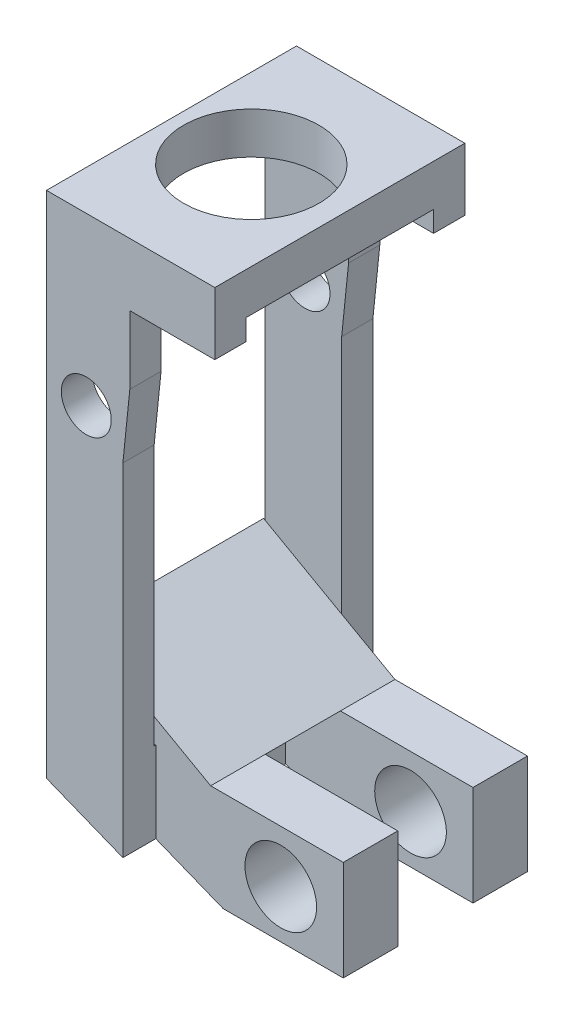
ISO-10303-21;
HEADER;
FILE_DESCRIPTION(('STEP AP214'),'2;1');
FILE_NAME('part.step','',(''),(''),'','','');
FILE_SCHEMA(('AUTOMOTIVE_DESIGN { 1 0 10303 214 1 1 1 1 }'));
ENDSEC;
DATA;
#1=APPLICATION_CONTEXT('core data for automotive mechanical design processes');
#2=APPLICATION_PROTOCOL_DEFINITION('international standard','automotive_design',2000,#1);
#3=PRODUCT_CONTEXT('',#1,'mechanical');
#4=PRODUCT('Part','Part','',(#3));
#5=PRODUCT_RELATED_PRODUCT_CATEGORY('part','',(#4));
#6=PRODUCT_DEFINITION_FORMATION('','',#4);
#7=PRODUCT_DEFINITION_CONTEXT('part definition',#1,'design');
#8=PRODUCT_DEFINITION('design','',#6,#7);
#9=PRODUCT_DEFINITION_SHAPE('','',#8);
#10=(LENGTH_UNIT() NAMED_UNIT(*) SI_UNIT(.MILLI.,.METRE.));
#11=(NAMED_UNIT(*) PLANE_ANGLE_UNIT() SI_UNIT($,.RADIAN.));
#12=(NAMED_UNIT(*) SI_UNIT($,.STERADIAN.) SOLID_ANGLE_UNIT());
#13=UNCERTAINTY_MEASURE_WITH_UNIT(LENGTH_MEASURE(1.E-05),#10,'distance_accuracy_value','');
#14=(GEOMETRIC_REPRESENTATION_CONTEXT(3) GLOBAL_UNCERTAINTY_ASSIGNED_CONTEXT((#13)) GLOBAL_UNIT_ASSIGNED_CONTEXT((#10,
#11,#12)) REPRESENTATION_CONTEXT('',''));
#15=CARTESIAN_POINT('',(0.,0.,0.));
#16=DIRECTION('',(0.,0.,1.));
#17=DIRECTION('',(1.,0.,0.));
#18=AXIS2_PLACEMENT_3D('',#15,#16,#17);
#19=CARTESIAN_POINT('',(-0.163336804675395,-25.5,4.5));
#20=DIRECTION('',(-1.,0.,0.));
#21=DIRECTION('',(0.,0.,1.));
#22=AXIS2_PLACEMENT_3D('',#19,#20,#21);
#23=PLANE('',#22);
#24=DIRECTION('',(0.,-1.,0.));
#25=VECTOR('',#24,1.);
#26=CARTESIAN_POINT('',(-0.163336804675397,-20.390050772096,-1.80504704323872));
#27=LINE('',#26,#25);
#28=CARTESIAN_POINT('',(-0.163336804675397,-20.390050772096,-1.80504704323872));
#29=VERTEX_POINT('',#28);
#30=CARTESIAN_POINT('',(-0.163336804675396,-23.9060070275788,-1.80504704323872));
#31=VERTEX_POINT('',#30);
#32=EDGE_CURVE('E373',#29,#31,#27,.T.);
#33=ORIENTED_EDGE('',*,*,#32,.F.);
#34=DIRECTION('',(0.,0.,1.));
#35=VECTOR('',#34,1.);
#36=CARTESIAN_POINT('',(-0.163336804675395,-20.390050772096,4.5));
#37=LINE('',#36,#35);
#38=CARTESIAN_POINT('',(-0.163336804675396,-20.390050772096,1.80504704323873));
#39=VERTEX_POINT('',#38);
#40=EDGE_CURVE('E280',#29,#39,#37,.T.);
#41=ORIENTED_EDGE('',*,*,#40,.T.);
#42=DIRECTION('',(0.,1.,0.));
#43=VECTOR('',#42,1.);
#44=CARTESIAN_POINT('',(-0.163336804675395,-20.390050772096,1.80504704323873));
#45=LINE('',#44,#43);
#46=CARTESIAN_POINT('',(-0.163336804675396,-23.9060070275788,1.80504704323873));
#47=VERTEX_POINT('',#46);
#48=EDGE_CURVE('E342',#47,#39,#45,.T.);
#49=ORIENTED_EDGE('',*,*,#48,.F.);
#50=DIRECTION('',(0.,0.,-1.));
#51=VECTOR('',#50,1.);
#52=CARTESIAN_POINT('',(-0.163336804675395,-23.9060070275788,4.5));
#53=LINE('',#52,#51);
#54=EDGE_CURVE('E305',#47,#31,#53,.T.);
#55=ORIENTED_EDGE('',*,*,#54,.T.);
#56=EDGE_LOOP('',(#33,#41,#49,#55));
#57=FACE_BOUND('',#56,.T.);
#58=ADVANCED_FACE('F41',(#57),#23,.F.);
#59=DIRECTION('',(0.,-1.,0.));
#60=VECTOR('',#59,1.);
#61=CARTESIAN_POINT('',(-0.163336804675395,-20.390050772096,4.42162899846874));
#62=LINE('',#61,#60);
#63=CARTESIAN_POINT('',(-0.163336804675395,-20.017389390198,4.42162899846874));
#64=VERTEX_POINT('',#63);
#65=CARTESIAN_POINT('',(-0.163336804675395,-23.9060070275788,4.42162899846874));
#66=VERTEX_POINT('',#65);
#67=EDGE_CURVE('E336',#64,#66,#62,.T.);
#68=ORIENTED_EDGE('',*,*,#67,.F.);
#69=DIRECTION('',(0.,0.,1.));
#70=VECTOR('',#69,1.);
#71=CARTESIAN_POINT('',(-0.163336804675396,-20.017389390198,-4.5));
#72=LINE('',#71,#70);
#73=CARTESIAN_POINT('',(-0.163336804675395,-20.017389390198,4.5));
#74=VERTEX_POINT('',#73);
#75=EDGE_CURVE('E412',#64,#74,#72,.T.);
#76=ORIENTED_EDGE('',*,*,#75,.T.);
#77=DIRECTION('',(0.,1.,0.));
#78=VECTOR('',#77,1.);
#79=CARTESIAN_POINT('',(-0.163336804675395,-25.5,4.5));
#80=LINE('',#79,#78);
#81=CARTESIAN_POINT('',(-0.163336804675395,-7.5,4.5));
#82=VERTEX_POINT('',#81);
#83=EDGE_CURVE('E432',#74,#82,#80,.T.);
#84=ORIENTED_EDGE('',*,*,#83,.T.);
#85=DIRECTION('',(0.,0.,-1.));
#86=VECTOR('',#85,1.);
#87=CARTESIAN_POINT('',(-0.163336804675395,-7.5,6.));
#88=LINE('',#87,#86);
#89=CARTESIAN_POINT('',(-0.163336804675394,-7.5,6.));
#90=VERTEX_POINT('',#89);
#91=EDGE_CURVE('E470',#90,#82,#88,.T.);
#92=ORIENTED_EDGE('',*,*,#91,.F.);
#93=DIRECTION('',(0.,1.,0.));
#94=VECTOR('',#93,1.);
#95=CARTESIAN_POINT('',(-0.163336804675394,-25.5,6.));
#96=LINE('',#95,#94);
#97=CARTESIAN_POINT('',(-0.163336804675392,-23.9060070275788,6.));
#98=VERTEX_POINT('',#97);
#99=EDGE_CURVE('E429',#98,#90,#96,.T.);
#100=ORIENTED_EDGE('',*,*,#99,.F.);
#101=EDGE_CURVE('E311',#98,#66,#53,.T.);
#102=ORIENTED_EDGE('',*,*,#101,.T.);
#103=EDGE_LOOP('',(#68,#76,#84,#92,#100,#102));
#104=FACE_BOUND('',#103,.T.);
#105=ADVANCED_FACE('F605',(#104),#23,.F.);
#106=CARTESIAN_POINT('',(-3.83093732248372,-20.017389390198,-4.5));
#107=DIRECTION('',(0.,-1.,0.));
#108=DIRECTION('',(0.,0.,-1.));
#109=AXIS2_PLACEMENT_3D('',#106,#107,#108);
#110=PLANE('',#109);
#111=DIRECTION('',(1.,0.,0.));
#112=VECTOR('',#111,1.);
#113=CARTESIAN_POINT('',(-3.83093732248372,-20.017389390198,4.42162899846874));
#114=LINE('',#113,#112);
#115=CARTESIAN_POINT('',(-3.83093732248372,-20.017389390198,4.42162899846874));
#116=VERTEX_POINT('',#115);
#117=EDGE_CURVE('E57',#116,#64,#114,.T.);
#118=ORIENTED_EDGE('',*,*,#117,.F.);
#119=DIRECTION('',(0.,0.,1.));
#120=VECTOR('',#119,1.);
#121=CARTESIAN_POINT('',(-3.83093732248372,-20.017389390198,-4.5));
#122=LINE('',#121,#120);
#123=CARTESIAN_POINT('',(-3.83093732248372,-20.017389390198,4.5));
#124=VERTEX_POINT('',#123);
#125=EDGE_CURVE('E420',#116,#124,#122,.T.);
#126=ORIENTED_EDGE('',*,*,#125,.T.);
#127=DIRECTION('',(1.,0.,0.));
#128=VECTOR('',#127,1.);
#129=CARTESIAN_POINT('',(-3.83093732248372,-20.017389390198,4.5));
#130=LINE('',#129,#128);
#131=EDGE_CURVE('E407',#124,#74,#130,.T.);
#132=ORIENTED_EDGE('',*,*,#131,.T.);
#133=ORIENTED_EDGE('',*,*,#75,.F.);
#134=EDGE_LOOP('',(#118,#126,#132,#133));
#135=FACE_BOUND('',#134,.T.);
#136=ADVANCED_FACE('F607',(#135),#110,.F.);
#137=CARTESIAN_POINT('',(-0.163336804675396,-20.017389390198,-4.5));
#138=VERTEX_POINT('',#137);
#139=CARTESIAN_POINT('',(-0.163336804675396,-20.017389390198,-4.42162899846873));
#140=VERTEX_POINT('',#139);
#141=EDGE_CURVE('E416',#138,#140,#72,.T.);
#142=ORIENTED_EDGE('',*,*,#141,.T.);
#143=DIRECTION('',(0.,1.,0.));
#144=VECTOR('',#143,1.);
#145=CARTESIAN_POINT('',(-0.163336804675397,-20.390050772096,-4.42162899846873));
#146=LINE('',#145,#144);
#147=CARTESIAN_POINT('',(-0.163336804675398,-23.9060070275788,-4.42162899846873));
#148=VERTEX_POINT('',#147);
#149=EDGE_CURVE('E379',#148,#140,#146,.T.);
#150=ORIENTED_EDGE('',*,*,#149,.F.);
#151=CARTESIAN_POINT('',(-0.163336804675394,-23.9060070275788,-6.));
#152=VERTEX_POINT('',#151);
#153=EDGE_CURVE('E310',#148,#152,#53,.T.);
#154=ORIENTED_EDGE('',*,*,#153,.T.);
#155=DIRECTION('',(0.,1.,0.));
#156=VECTOR('',#155,1.);
#157=CARTESIAN_POINT('',(-0.163336804675397,-25.5,-6.));
#158=LINE('',#157,#156);
#159=CARTESIAN_POINT('',(-0.163336804675397,-7.5,-6.));
#160=VERTEX_POINT('',#159);
#161=EDGE_CURVE('E426',#152,#160,#158,.T.);
#162=ORIENTED_EDGE('',*,*,#161,.T.);
#163=CARTESIAN_POINT('',(-0.163336804675397,-7.5,-4.5));
#164=VERTEX_POINT('',#163);
#165=EDGE_CURVE('E461',#164,#160,#88,.T.);
#166=ORIENTED_EDGE('',*,*,#165,.F.);
#167=DIRECTION('',(0.,1.,0.));
#168=VECTOR('',#167,1.);
#169=CARTESIAN_POINT('',(-0.163336804675397,-25.5,-4.5));
#170=LINE('',#169,#168);
#171=EDGE_CURVE('E423',#138,#164,#170,.T.);
#172=ORIENTED_EDGE('',*,*,#171,.F.);
#173=EDGE_LOOP('',(#142,#150,#154,#162,#166,#172));
#174=FACE_BOUND('',#173,.T.);
#175=ADVANCED_FACE('F641',(#174),#23,.F.);
#176=CARTESIAN_POINT('',(0.,-1.,4.5));
#177=DIRECTION('',(0.,0.,-1.));
#178=DIRECTION('',(-1.,0.,0.));
#179=AXIS2_PLACEMENT_3D('',#176,#177,#178);
#180=PLANE('',#179);
#181=CARTESIAN_POINT('',(-1.92090556412277,-6.,4.5));
#182=DIRECTION('',(0.,0.,-1.));
#183=DIRECTION('',(-1.,0.,0.));
#184=AXIS2_PLACEMENT_3D('',#181,#182,#183);
#185=CIRCLE('',#184,1.2);
#186=CARTESIAN_POINT('',(-3.12090556412277,-6.,4.5));
#187=VERTEX_POINT('',#186);
#188=EDGE_CURVE('E452',#187,#187,#185,.T.);
#189=ORIENTED_EDGE('',*,*,#188,.F.);
#190=EDGE_LOOP('',(#189));
#191=FACE_BOUND('',#190,.T.);
#192=ORIENTED_EDGE('',*,*,#83,.F.);
#193=ORIENTED_EDGE('',*,*,#131,.F.);
#194=DIRECTION('',(0.,1.,0.));
#195=VECTOR('',#194,1.);
#196=CARTESIAN_POINT('',(-3.83093732248372,-7.5,4.5));
#197=LINE('',#196,#195);
#198=CARTESIAN_POINT('',(-3.83093732248372,0.,4.5));
#199=VERTEX_POINT('',#198);
#200=EDGE_CURVE('E484',#124,#199,#197,.T.);
#201=ORIENTED_EDGE('',*,*,#200,.T.);
#202=DIRECTION('',(-1.,0.,0.));
#203=VECTOR('',#202,1.);
#204=CARTESIAN_POINT('',(0.,0.,4.5));
#205=LINE('',#204,#203);
#206=CARTESIAN_POINT('',(4.25,0.,4.5));
#207=VERTEX_POINT('',#206);
#208=EDGE_CURVE('E531',#207,#199,#205,.T.);
#209=ORIENTED_EDGE('',*,*,#208,.F.);
#210=DIRECTION('',(0.,1.,0.));
#211=VECTOR('',#210,1.);
#212=CARTESIAN_POINT('',(4.25,-1.,4.5));
#213=LINE('',#212,#211);
#214=CARTESIAN_POINT('',(4.25,-1.,4.5));
#215=VERTEX_POINT('',#214);
#216=EDGE_CURVE('E544',#215,#207,#213,.T.);
#217=ORIENTED_EDGE('',*,*,#216,.F.);
#218=DIRECTION('',(-1.,0.,0.));
#219=VECTOR('',#218,1.);
#220=CARTESIAN_POINT('',(0.,-1.,4.5));
#221=LINE('',#220,#219);
#222=CARTESIAN_POINT('',(0.169062677516282,-1.,4.5));
#223=VERTEX_POINT('',#222);
#224=EDGE_CURVE('E536',#215,#223,#221,.T.);
#225=ORIENTED_EDGE('',*,*,#224,.T.);
#226=DIRECTION('',(0.,1.,0.));
#227=VECTOR('',#226,1.);
#228=CARTESIAN_POINT('',(0.169062677516282,-7.5,4.5));
#229=LINE('',#228,#227);
#230=CARTESIAN_POINT('',(0.169062677516284,-4.27024689603785,4.5));
#231=VERTEX_POINT('',#230);
#232=EDGE_CURVE('E493',#231,#223,#229,.T.);
#233=ORIENTED_EDGE('',*,*,#232,.F.);
#234=DIRECTION('',(0.102377156990569,0.994745654791479,0.));
#235=VECTOR('',#234,1.);
#236=CARTESIAN_POINT('',(0.500330150243472,-1.05149294002126,4.5));
#237=LINE('',#236,#235);
#238=EDGE_CURVE('E477',#82,#231,#237,.T.);
#239=ORIENTED_EDGE('',*,*,#238,.F.);
#240=EDGE_LOOP('',(#192,#193,#201,#209,#217,#225,#233,#239));
#241=FACE_BOUND('',#240,.T.);
#242=ADVANCED_FACE('F662',(#191,#241),#180,.T.);
#243=CARTESIAN_POINT('',(0.,-1.,-4.5));
#244=DIRECTION('',(0.,0.,-1.));
#245=DIRECTION('',(-1.,0.,0.));
#246=AXIS2_PLACEMENT_3D('',#243,#244,#245);
#247=PLANE('',#246);
#248=CARTESIAN_POINT('',(-1.92090556412277,-6.,-4.5));
#249=DIRECTION('',(0.,0.,-1.));
#250=DIRECTION('',(-1.,0.,0.));
#251=AXIS2_PLACEMENT_3D('',#248,#249,#250);
#252=CIRCLE('',#251,1.2);
#253=CARTESIAN_POINT('',(-3.12090556412277,-6.,-4.5));
#254=VERTEX_POINT('',#253);
#255=EDGE_CURVE('E448',#254,#254,#252,.T.);
#256=ORIENTED_EDGE('',*,*,#255,.T.);
#257=EDGE_LOOP('',(#256));
#258=FACE_BOUND('',#257,.T.);
#259=DIRECTION('',(1.,0.,0.));
#260=VECTOR('',#259,1.);
#261=CARTESIAN_POINT('',(-3.83093732248372,-20.017389390198,-4.5));
#262=LINE('',#261,#260);
#263=CARTESIAN_POINT('',(-3.83093732248372,-20.017389390198,-4.5));
#264=VERTEX_POINT('',#263);
#265=EDGE_CURVE('E408',#264,#138,#262,.T.);
#266=ORIENTED_EDGE('',*,*,#265,.T.);
#267=ORIENTED_EDGE('',*,*,#171,.T.);
#268=DIRECTION('',(0.102377156990569,0.994745654791479,0.));
#269=VECTOR('',#268,1.);
#270=CARTESIAN_POINT('',(0.50033015024347,-1.05149294002126,-4.5));
#271=LINE('',#270,#269);
#272=CARTESIAN_POINT('',(0.169062677516282,-4.27024689603785,-4.5));
#273=VERTEX_POINT('',#272);
#274=EDGE_CURVE('E468',#164,#273,#271,.T.);
#275=ORIENTED_EDGE('',*,*,#274,.T.);
#276=DIRECTION('',(0.,1.,0.));
#277=VECTOR('',#276,1.);
#278=CARTESIAN_POINT('',(0.169062677516282,-7.5,-4.5));
#279=LINE('',#278,#277);
#280=CARTESIAN_POINT('',(0.169062677516282,-1.,-4.5));
#281=VERTEX_POINT('',#280);
#282=EDGE_CURVE('E506',#273,#281,#279,.T.);
#283=ORIENTED_EDGE('',*,*,#282,.T.);
#284=DIRECTION('',(-1.,0.,0.));
#285=VECTOR('',#284,1.);
#286=CARTESIAN_POINT('',(0.,-1.,-4.5));
#287=LINE('',#286,#285);
#288=CARTESIAN_POINT('',(4.25,-1.,-4.5));
#289=VERTEX_POINT('',#288);
#290=EDGE_CURVE('E513',#289,#281,#287,.T.);
#291=ORIENTED_EDGE('',*,*,#290,.F.);
#292=DIRECTION('',(0.,1.,0.));
#293=VECTOR('',#292,1.);
#294=CARTESIAN_POINT('',(4.25,-1.,-4.5));
#295=LINE('',#294,#293);
#296=CARTESIAN_POINT('',(4.25,0.,-4.5));
#297=VERTEX_POINT('',#296);
#298=EDGE_CURVE('E525',#289,#297,#295,.T.);
#299=ORIENTED_EDGE('',*,*,#298,.T.);
#300=DIRECTION('',(-1.,0.,0.));
#301=VECTOR('',#300,1.);
#302=CARTESIAN_POINT('',(0.,0.,-4.5));
#303=LINE('',#302,#301);
#304=CARTESIAN_POINT('',(-3.83093732248372,0.,-4.5));
#305=VERTEX_POINT('',#304);
#306=EDGE_CURVE('E512',#297,#305,#303,.T.);
#307=ORIENTED_EDGE('',*,*,#306,.T.);
#308=DIRECTION('',(0.,1.,0.));
#309=VECTOR('',#308,1.);
#310=CARTESIAN_POINT('',(-3.83093732248372,-7.5,-4.5));
#311=LINE('',#310,#309);
#312=EDGE_CURVE('E503',#264,#305,#311,.T.);
#313=ORIENTED_EDGE('',*,*,#312,.F.);
#314=EDGE_LOOP('',(#266,#267,#275,#283,#291,#299,#307,#313));
#315=FACE_BOUND('',#314,.T.);
#316=ADVANCED_FACE('F706',(#258,#315),#247,.F.);
#317=CARTESIAN_POINT('',(0.,-1.,0.));
#318=DIRECTION('',(0.,1.,0.));
#319=DIRECTION('',(0.,0.,1.));
#320=AXIS2_PLACEMENT_3D('',#317,#318,#319);
#321=PLANE('',#320);
#322=DIRECTION('',(0.,0.,1.));
#323=VECTOR('',#322,1.);
#324=CARTESIAN_POINT('',(0.169062677516282,-1.,4.5));
#325=LINE('',#324,#323);
#326=CARTESIAN_POINT('',(0.169062677516282,-1.,6.));
#327=VERTEX_POINT('',#326);
#328=EDGE_CURVE('E480',#223,#327,#325,.T.);
#329=ORIENTED_EDGE('',*,*,#328,.F.);
#330=ORIENTED_EDGE('',*,*,#224,.F.);
#331=DIRECTION('',(0.,0.,1.));
#332=VECTOR('',#331,1.);
#333=CARTESIAN_POINT('',(4.25,-1.,0.));
#334=LINE('',#333,#332);
#335=CARTESIAN_POINT('',(4.25,-1.,6.));
#336=VERTEX_POINT('',#335);
#337=EDGE_CURVE('E532',#215,#336,#334,.T.);
#338=ORIENTED_EDGE('',*,*,#337,.T.);
#339=DIRECTION('',(-1.,0.,0.));
#340=VECTOR('',#339,1.);
#341=CARTESIAN_POINT('',(0.,-1.,6.));
#342=LINE('',#341,#340);
#343=EDGE_CURVE('E540',#336,#327,#342,.T.);
#344=ORIENTED_EDGE('',*,*,#343,.T.);
#345=EDGE_LOOP('',(#329,#330,#338,#344));
#346=FACE_BOUND('',#345,.T.);
#347=ADVANCED_FACE('F680',(#346),#321,.F.);
#348=CARTESIAN_POINT('',(0.,-1.,0.));
#349=DIRECTION('',(0.,1.,0.));
#350=DIRECTION('',(0.,0.,1.));
#351=AXIS2_PLACEMENT_3D('',#348,#349,#350);
#352=PLANE('',#351);
#353=DIRECTION('',(0.,0.,1.));
#354=VECTOR('',#353,1.);
#355=CARTESIAN_POINT('',(0.169062677516282,-1.,-6.));
#356=LINE('',#355,#354);
#357=CARTESIAN_POINT('',(0.169062677516282,-1.,-6.));
#358=VERTEX_POINT('',#357);
#359=EDGE_CURVE('E496',#358,#281,#356,.T.);
#360=ORIENTED_EDGE('',*,*,#359,.F.);
#361=DIRECTION('',(-1.,0.,0.));
#362=VECTOR('',#361,1.);
#363=CARTESIAN_POINT('',(0.,-1.,-6.));
#364=LINE('',#363,#362);
#365=CARTESIAN_POINT('',(4.25,-1.,-6.));
#366=VERTEX_POINT('',#365);
#367=EDGE_CURVE('E521',#366,#358,#364,.T.);
#368=ORIENTED_EDGE('',*,*,#367,.F.);
#369=DIRECTION('',(0.,0.,-1.));
#370=VECTOR('',#369,1.);
#371=CARTESIAN_POINT('',(4.25,-1.,0.));
#372=LINE('',#371,#370);
#373=EDGE_CURVE('E517',#289,#366,#372,.T.);
#374=ORIENTED_EDGE('',*,*,#373,.F.);
#375=ORIENTED_EDGE('',*,*,#290,.T.);
#376=EDGE_LOOP('',(#360,#368,#374,#375));
#377=FACE_BOUND('',#376,.T.);
#378=ADVANCED_FACE('F704',(#377),#352,.F.);
#379=CARTESIAN_POINT('',(0.,0.,0.));
#380=DIRECTION('',(0.,1.,0.));
#381=DIRECTION('',(0.,0.,1.));
#382=AXIS2_PLACEMENT_3D('',#379,#380,#381);
#383=PLANE('',#382);
#384=CARTESIAN_POINT('',(0.,0.,0.));
#385=DIRECTION('',(0.,1.,0.));
#386=DIRECTION('',(0.,0.,1.));
#387=AXIS2_PLACEMENT_3D('',#384,#385,#386);
#388=CIRCLE('',#387,3.25);
#389=CARTESIAN_POINT('',(0.,0.,3.25));
#390=VERTEX_POINT('',#389);
#391=EDGE_CURVE('E550',#390,#390,#388,.T.);
#392=ORIENTED_EDGE('',*,*,#391,.T.);
#393=EDGE_LOOP('',(#392));
#394=FACE_BOUND('',#393,.T.);
#395=ORIENTED_EDGE('',*,*,#208,.T.);
#396=DIRECTION('',(0.,0.,-1.));
#397=VECTOR('',#396,1.);
#398=CARTESIAN_POINT('',(-3.83093732248372,0.,0.));
#399=LINE('',#398,#397);
#400=EDGE_CURVE('E439',#199,#305,#399,.T.);
#401=ORIENTED_EDGE('',*,*,#400,.T.);
#402=ORIENTED_EDGE('',*,*,#306,.F.);
#403=DIRECTION('',(0.,0.,-1.));
#404=VECTOR('',#403,1.);
#405=CARTESIAN_POINT('',(4.25,0.,0.));
#406=LINE('',#405,#404);
#407=EDGE_CURVE('E556',#207,#297,#406,.T.);
#408=ORIENTED_EDGE('',*,*,#407,.F.);
#409=EDGE_LOOP('',(#395,#401,#402,#408));
#410=FACE_BOUND('',#409,.T.);
#411=ADVANCED_FACE('F670',(#394,#410),#383,.F.);
#412=CARTESIAN_POINT('',(4.25,2.,0.));
#413=DIRECTION('',(-1.,0.,0.));
#414=DIRECTION('',(0.,0.,1.));
#415=AXIS2_PLACEMENT_3D('',#412,#413,#414);
#416=PLANE('',#415);
#417=DIRECTION('',(0.,-1.,0.));
#418=VECTOR('',#417,1.);
#419=CARTESIAN_POINT('',(4.25,2.,6.));
#420=LINE('',#419,#418);
#421=CARTESIAN_POINT('',(4.25,2.,6.));
#422=VERTEX_POINT('',#421);
#423=EDGE_CURVE('E568',#422,#336,#420,.T.);
#424=ORIENTED_EDGE('',*,*,#423,.T.);
#425=ORIENTED_EDGE('',*,*,#337,.F.);
#426=ORIENTED_EDGE('',*,*,#216,.T.);
#427=ORIENTED_EDGE('',*,*,#407,.T.);
#428=ORIENTED_EDGE('',*,*,#298,.F.);
#429=ORIENTED_EDGE('',*,*,#373,.T.);
#430=DIRECTION('',(0.,-1.,0.));
#431=VECTOR('',#430,1.);
#432=CARTESIAN_POINT('',(4.25,2.,-6.));
#433=LINE('',#432,#431);
#434=CARTESIAN_POINT('',(4.25,2.,-6.));
#435=VERTEX_POINT('',#434);
#436=EDGE_CURVE('E50',#435,#366,#433,.T.);
#437=ORIENTED_EDGE('',*,*,#436,.F.);
#438=DIRECTION('',(0.,0.,-1.));
#439=VECTOR('',#438,1.);
#440=CARTESIAN_POINT('',(4.25,2.,0.));
#441=LINE('',#440,#439);
#442=EDGE_CURVE('E555',#422,#435,#441,.T.);
#443=ORIENTED_EDGE('',*,*,#442,.F.);
#444=EDGE_LOOP('',(#424,#425,#426,#427,#428,#429,#437,#443));
#445=FACE_BOUND('',#444,.T.);
#446=ADVANCED_FACE('F675',(#445),#416,.F.);
#447=CARTESIAN_POINT('',(0.,2.,-6.));
#448=DIRECTION('',(0.,0.,1.));
#449=DIRECTION('',(1.,0.,0.));
#450=AXIS2_PLACEMENT_3D('',#447,#448,#449);
#451=PLANE('',#450);
#452=CARTESIAN_POINT('',(-1.92090556412277,-6.,-6.));
#453=DIRECTION('',(0.,0.,-1.));
#454=DIRECTION('',(-1.,0.,0.));
#455=AXIS2_PLACEMENT_3D('',#452,#453,#454);
#456=CIRCLE('',#455,1.2);
#457=CARTESIAN_POINT('',(-3.12090556412277,-6.,-6.));
#458=VERTEX_POINT('',#457);
#459=EDGE_CURVE('E443',#458,#458,#456,.T.);
#460=ORIENTED_EDGE('',*,*,#459,.F.);
#461=EDGE_LOOP('',(#460));
#462=FACE_BOUND('',#461,.T.);
#463=ORIENTED_EDGE('',*,*,#161,.F.);
#464=DIRECTION('',(0.928615351746912,-0.371043836358939,0.));
#465=VECTOR('',#464,1.);
#466=CARTESIAN_POINT('',(-3.83093732248372,-22.4405557362561,-6.));
#467=LINE('',#466,#465);
#468=CARTESIAN_POINT('',(-3.83093732248372,-22.4405557362561,-6.));
#469=VERTEX_POINT('',#468);
#470=EDGE_CURVE('E290',#469,#152,#467,.T.);
#471=ORIENTED_EDGE('',*,*,#470,.F.);
#472=DIRECTION('',(0.,1.,0.));
#473=VECTOR('',#472,1.);
#474=CARTESIAN_POINT('',(-3.83093732248372,-7.5,-6.));
#475=LINE('',#474,#473);
#476=CARTESIAN_POINT('',(-3.83093732248372,2.,-6.));
#477=VERTEX_POINT('',#476);
#478=EDGE_CURVE('E500',#469,#477,#475,.T.);
#479=ORIENTED_EDGE('',*,*,#478,.T.);
#480=DIRECTION('',(-1.,0.,0.));
#481=VECTOR('',#480,1.);
#482=CARTESIAN_POINT('',(0.,2.,-6.));
#483=LINE('',#482,#481);
#484=EDGE_CURVE('E560',#435,#477,#483,.T.);
#485=ORIENTED_EDGE('',*,*,#484,.F.);
#486=ORIENTED_EDGE('',*,*,#436,.T.);
#487=ORIENTED_EDGE('',*,*,#367,.T.);
#488=DIRECTION('',(0.,1.,0.));
#489=VECTOR('',#488,1.);
#490=CARTESIAN_POINT('',(0.169062677516282,-7.5,-6.));
#491=LINE('',#490,#489);
#492=CARTESIAN_POINT('',(0.169062677516282,-4.27024689603785,-6.));
#493=VERTEX_POINT('',#492);
#494=EDGE_CURVE('E509',#493,#358,#491,.T.);
#495=ORIENTED_EDGE('',*,*,#494,.F.);
#496=DIRECTION('',(0.102377156990569,0.994745654791479,0.));
#497=VECTOR('',#496,1.);
#498=CARTESIAN_POINT('',(0.169062677516282,-4.27024689603785,-6.));
#499=LINE('',#498,#497);
#500=EDGE_CURVE('E456',#160,#493,#499,.T.);
#501=ORIENTED_EDGE('',*,*,#500,.F.);
#502=EDGE_LOOP('',(#463,#471,#479,#485,#486,#487,#495,#501));
#503=FACE_BOUND('',#502,.T.);
#504=ADVANCED_FACE('F647',(#462,#503),#451,.F.);
#505=CARTESIAN_POINT('',(0.,2.,0.));
#506=DIRECTION('',(0.,-1.,0.));
#507=DIRECTION('',(0.,0.,-1.));
#508=AXIS2_PLACEMENT_3D('',#505,#506,#507);
#509=CYLINDRICAL_SURFACE('',#508,3.25);
#510=CARTESIAN_POINT('',(0.,2.,0.));
#511=DIRECTION('',(0.,1.,0.));
#512=DIRECTION('',(0.,0.,1.));
#513=AXIS2_PLACEMENT_3D('',#510,#511,#512);
#514=CIRCLE('',#513,3.25);
#515=CARTESIAN_POINT('',(0.,2.,3.25));
#516=VERTEX_POINT('',#515);
#517=EDGE_CURVE('E551',#516,#516,#514,.T.);
#518=ORIENTED_EDGE('',*,*,#517,.T.);
#519=EDGE_LOOP('',(#518));
#520=FACE_BOUND('',#519,.T.);
#521=ORIENTED_EDGE('',*,*,#391,.F.);
#522=EDGE_LOOP('',(#521));
#523=FACE_BOUND('',#522,.T.);
#524=ADVANCED_FACE('F43',(#520,#523),#509,.F.);
#525=CARTESIAN_POINT('',(0.,2.,6.));
#526=DIRECTION('',(0.,0.,1.));
#527=DIRECTION('',(1.,0.,0.));
#528=AXIS2_PLACEMENT_3D('',#525,#526,#527);
#529=PLANE('',#528);
#530=DIRECTION('',(0.928615351746912,-0.371043836358939,0.));
#531=VECTOR('',#530,1.);
#532=CARTESIAN_POINT('',(-3.83093732248372,-22.4405557362561,6.));
#533=LINE('',#532,#531);
#534=CARTESIAN_POINT('',(-3.83093732248372,-22.4405557362561,6.));
#535=VERTEX_POINT('',#534);
#536=EDGE_CURVE('E291',#535,#98,#533,.T.);
#537=ORIENTED_EDGE('',*,*,#536,.T.);
#538=ORIENTED_EDGE('',*,*,#99,.T.);
#539=DIRECTION('',(0.102377156990569,0.994745654791479,0.));
#540=VECTOR('',#539,1.);
#541=CARTESIAN_POINT('',(0.169062677516284,-4.27024689603785,6.));
#542=LINE('',#541,#540);
#543=CARTESIAN_POINT('',(0.169062677516284,-4.27024689603785,6.));
#544=VERTEX_POINT('',#543);
#545=EDGE_CURVE('E457',#90,#544,#542,.T.);
#546=ORIENTED_EDGE('',*,*,#545,.T.);
#547=DIRECTION('',(0.,1.,0.));
#548=VECTOR('',#547,1.);
#549=CARTESIAN_POINT('',(0.169062677516282,-7.5,6.));
#550=LINE('',#549,#548);
#551=EDGE_CURVE('E490',#544,#327,#550,.T.);
#552=ORIENTED_EDGE('',*,*,#551,.T.);
#553=ORIENTED_EDGE('',*,*,#343,.F.);
#554=ORIENTED_EDGE('',*,*,#423,.F.);
#555=DIRECTION('',(-1.,0.,0.));
#556=VECTOR('',#555,1.);
#557=CARTESIAN_POINT('',(0.,2.,6.));
#558=LINE('',#557,#556);
#559=CARTESIAN_POINT('',(-3.83093732248372,2.,6.));
#560=VERTEX_POINT('',#559);
#561=EDGE_CURVE('E564',#422,#560,#558,.T.);
#562=ORIENTED_EDGE('',*,*,#561,.T.);
#563=DIRECTION('',(0.,1.,0.));
#564=VECTOR('',#563,1.);
#565=CARTESIAN_POINT('',(-3.83093732248372,-7.5,6.));
#566=LINE('',#565,#564);
#567=EDGE_CURVE('E487',#535,#560,#566,.T.);
#568=ORIENTED_EDGE('',*,*,#567,.F.);
#569=EDGE_LOOP('',(#537,#538,#546,#552,#553,#554,#562,#568));
#570=FACE_BOUND('',#569,.T.);
#571=CARTESIAN_POINT('',(-1.92090556412277,-6.,6.));
#572=DIRECTION('',(0.,0.,-1.));
#573=DIRECTION('',(-1.,0.,0.));
#574=AXIS2_PLACEMENT_3D('',#571,#572,#573);
#575=CIRCLE('',#574,1.2);
#576=CARTESIAN_POINT('',(-3.12090556412277,-6.,6.));
#577=VERTEX_POINT('',#576);
#578=EDGE_CURVE('E444',#577,#577,#575,.T.);
#579=ORIENTED_EDGE('',*,*,#578,.T.);
#580=EDGE_LOOP('',(#579));
#581=FACE_BOUND('',#580,.T.);
#582=ADVANCED_FACE('F689',(#570,#581),#529,.T.);
#583=CARTESIAN_POINT('',(0.,2.,0.));
#584=DIRECTION('',(0.,1.,0.));
#585=DIRECTION('',(0.,0.,1.));
#586=AXIS2_PLACEMENT_3D('',#583,#584,#585);
#587=PLANE('',#586);
#588=DIRECTION('',(0.,0.,-1.));
#589=VECTOR('',#588,1.);
#590=CARTESIAN_POINT('',(-3.83093732248371,2.,9.02912751921855));
#591=LINE('',#590,#589);
#592=EDGE_CURVE('E435',#560,#477,#591,.T.);
#593=ORIENTED_EDGE('',*,*,#592,.F.);
#594=ORIENTED_EDGE('',*,*,#561,.F.);
#595=ORIENTED_EDGE('',*,*,#442,.T.);
#596=ORIENTED_EDGE('',*,*,#484,.T.);
#597=EDGE_LOOP('',(#593,#594,#595,#596));
#598=FACE_BOUND('',#597,.T.);
#599=ORIENTED_EDGE('',*,*,#517,.F.);
#600=EDGE_LOOP('',(#599));
#601=FACE_BOUND('',#600,.T.);
#602=ADVANCED_FACE('F699',(#598,#601),#587,.T.);
#603=CARTESIAN_POINT('',(0.169062677516282,-7.5,-6.));
#604=DIRECTION('',(-1.,0.,0.));
#605=DIRECTION('',(0.,0.,1.));
#606=AXIS2_PLACEMENT_3D('',#603,#604,#605);
#607=PLANE('',#606);
#608=ORIENTED_EDGE('',*,*,#282,.F.);
#609=DIRECTION('',(0.,0.,-1.));
#610=VECTOR('',#609,1.);
#611=CARTESIAN_POINT('',(0.169062677516284,-4.27024689603785,6.));
#612=LINE('',#611,#610);
#613=EDGE_CURVE('E469',#273,#493,#612,.T.);
#614=ORIENTED_EDGE('',*,*,#613,.T.);
#615=ORIENTED_EDGE('',*,*,#494,.T.);
#616=ORIENTED_EDGE('',*,*,#359,.T.);
#617=EDGE_LOOP('',(#608,#614,#615,#616));
#618=FACE_BOUND('',#617,.T.);
#619=ADVANCED_FACE('F656',(#618),#607,.F.);
#620=CARTESIAN_POINT('',(-3.83093732248372,-7.5,-6.));
#621=DIRECTION('',(1.,0.,0.));
#622=DIRECTION('',(0.,0.,-1.));
#623=AXIS2_PLACEMENT_3D('',#620,#621,#622);
#624=PLANE('',#623);
#625=DIRECTION('',(0.,1.,0.));
#626=VECTOR('',#625,1.);
#627=CARTESIAN_POINT('',(-3.83093732248372,-16.8468429799836,-4.42162899846873));
#628=LINE('',#627,#626);
#629=CARTESIAN_POINT('',(-3.83093732248372,-20.017389390198,-4.42162899846873));
#630=VERTEX_POINT('',#629);
#631=CARTESIAN_POINT('',(-3.83093732248372,-16.8468429799836,-4.42162899846873));
#632=VERTEX_POINT('',#631);
#633=EDGE_CURVE('E241',#630,#632,#628,.T.);
#634=ORIENTED_EDGE('',*,*,#633,.F.);
#635=EDGE_CURVE('E65',#264,#630,#122,.T.);
#636=ORIENTED_EDGE('',*,*,#635,.F.);
#637=ORIENTED_EDGE('',*,*,#312,.T.);
#638=ORIENTED_EDGE('',*,*,#400,.F.);
#639=ORIENTED_EDGE('',*,*,#200,.F.);
#640=ORIENTED_EDGE('',*,*,#125,.F.);
#641=DIRECTION('',(0.,-1.,0.));
#642=VECTOR('',#641,1.);
#643=CARTESIAN_POINT('',(-3.83093732248371,-16.8468429799836,4.42162899846875));
#644=LINE('',#643,#642);
#645=CARTESIAN_POINT('',(-3.83093732248371,-16.8468429799836,4.42162899846875));
#646=VERTEX_POINT('',#645);
#647=EDGE_CURVE('E258',#646,#116,#644,.T.);
#648=ORIENTED_EDGE('',*,*,#647,.F.);
#649=DIRECTION('',(0.,0.,-1.));
#650=VECTOR('',#649,1.);
#651=CARTESIAN_POINT('',(-3.83093732248371,-16.8468429799836,11.6518027332107));
#652=LINE('',#651,#650);
#653=EDGE_CURVE('E254',#646,#632,#652,.T.);
#654=ORIENTED_EDGE('',*,*,#653,.T.);
#655=EDGE_LOOP('',(#634,#636,#637,#638,#639,#640,#648,#654));
#656=FACE_BOUND('',#655,.T.);
#657=ORIENTED_EDGE('',*,*,#478,.F.);
#658=DIRECTION('',(0.,0.,-1.));
#659=VECTOR('',#658,1.);
#660=CARTESIAN_POINT('',(-3.83093732248372,-22.4405557362561,6.));
#661=LINE('',#660,#659);
#662=EDGE_CURVE('E295',#535,#469,#661,.T.);
#663=ORIENTED_EDGE('',*,*,#662,.F.);
#664=ORIENTED_EDGE('',*,*,#567,.T.);
#665=ORIENTED_EDGE('',*,*,#592,.T.);
#666=EDGE_LOOP('',(#657,#663,#664,#665));
#667=FACE_BOUND('',#666,.T.);
#668=ADVANCED_FACE('F255',(#656,#667),#624,.F.);
#669=CARTESIAN_POINT('',(0.169062677516282,-7.5,4.5));
#670=DIRECTION('',(-1.,0.,0.));
#671=DIRECTION('',(0.,0.,1.));
#672=AXIS2_PLACEMENT_3D('',#669,#670,#671);
#673=PLANE('',#672);
#674=ORIENTED_EDGE('',*,*,#551,.F.);
#675=EDGE_CURVE('E464',#544,#231,#612,.T.);
#676=ORIENTED_EDGE('',*,*,#675,.T.);
#677=ORIENTED_EDGE('',*,*,#232,.T.);
#678=ORIENTED_EDGE('',*,*,#328,.T.);
#679=EDGE_LOOP('',(#674,#676,#677,#678));
#680=FACE_BOUND('',#679,.T.);
#681=ADVANCED_FACE('F683',(#680),#673,.F.);
#682=CARTESIAN_POINT('',(0.169062677516284,-4.27024689603785,6.));
#683=DIRECTION('',(-0.994745654791479,0.102377156990569,0.));
#684=DIRECTION('',(-0.102377156990569,-0.994745654791479,0.));
#685=AXIS2_PLACEMENT_3D('',#682,#683,#684);
#686=PLANE('',#685);
#687=ORIENTED_EDGE('',*,*,#238,.T.);
#688=ORIENTED_EDGE('',*,*,#675,.F.);
#689=ORIENTED_EDGE('',*,*,#545,.F.);
#690=ORIENTED_EDGE('',*,*,#91,.T.);
#691=EDGE_LOOP('',(#687,#688,#689,#690));
#692=FACE_BOUND('',#691,.T.);
#693=ADVANCED_FACE('F685',(#692),#686,.F.);
#694=ORIENTED_EDGE('',*,*,#165,.T.);
#695=ORIENTED_EDGE('',*,*,#500,.T.);
#696=ORIENTED_EDGE('',*,*,#613,.F.);
#697=ORIENTED_EDGE('',*,*,#274,.F.);
#698=EDGE_LOOP('',(#694,#695,#696,#697));
#699=FACE_BOUND('',#698,.T.);
#700=ADVANCED_FACE('F652',(#699),#686,.F.);
#701=CARTESIAN_POINT('',(-1.92090556412277,-6.,6.));
#702=DIRECTION('',(0.,0.,-1.));
#703=DIRECTION('',(-1.,0.,0.));
#704=AXIS2_PLACEMENT_3D('',#701,#702,#703);
#705=CYLINDRICAL_SURFACE('',#704,1.2);
#706=ORIENTED_EDGE('',*,*,#459,.T.);
#707=EDGE_LOOP('',(#706));
#708=FACE_BOUND('',#707,.T.);
#709=ORIENTED_EDGE('',*,*,#255,.F.);
#710=EDGE_LOOP('',(#709));
#711=FACE_BOUND('',#710,.T.);
#712=ADVANCED_FACE('F720',(#708,#711),#705,.F.);
#713=ORIENTED_EDGE('',*,*,#188,.T.);
#714=EDGE_LOOP('',(#713));
#715=FACE_BOUND('',#714,.T.);
#716=ORIENTED_EDGE('',*,*,#578,.F.);
#717=EDGE_LOOP('',(#716));
#718=FACE_BOUND('',#717,.T.);
#719=ADVANCED_FACE('F711',(#715,#718),#705,.F.);
#720=ORIENTED_EDGE('',*,*,#635,.T.);
#721=DIRECTION('',(1.,0.,0.));
#722=VECTOR('',#721,1.);
#723=CARTESIAN_POINT('',(-3.83093732248372,-20.017389390198,-4.42162899846873));
#724=LINE('',#723,#722);
#725=EDGE_CURVE('E248',#630,#140,#724,.T.);
#726=ORIENTED_EDGE('',*,*,#725,.T.);
#727=ORIENTED_EDGE('',*,*,#141,.F.);
#728=ORIENTED_EDGE('',*,*,#265,.F.);
#729=EDGE_LOOP('',(#720,#726,#727,#728));
#730=FACE_BOUND('',#729,.T.);
#731=ADVANCED_FACE('F708',(#730),#110,.F.);
#732=CARTESIAN_POINT('',(8.8366631953246,-20.390050772096,-1.80504704323872));
#733=DIRECTION('',(0.,0.,-1.));
#734=DIRECTION('',(-1.,0.,0.));
#735=AXIS2_PLACEMENT_3D('',#732,#733,#734);
#736=PLANE('',#735);
#737=CARTESIAN_POINT('',(5.8366631953246,-22.894386417209,-1.80504704323872));
#738=DIRECTION('',(0.,0.,-1.));
#739=DIRECTION('',(-1.,0.,0.));
#740=AXIS2_PLACEMENT_3D('',#737,#738,#739);
#741=CIRCLE('',#740,1.71916677260785);
#742=CARTESIAN_POINT('',(4.11749642271675,-22.894386417209,-1.80504704323872));
#743=VERTEX_POINT('',#742);
#744=EDGE_CURVE('E332',#743,#743,#741,.T.);
#745=ORIENTED_EDGE('',*,*,#744,.T.);
#746=EDGE_LOOP('',(#745));
#747=FACE_BOUND('',#746,.T.);
#748=ORIENTED_EDGE('',*,*,#32,.T.);
#749=DIRECTION('',(0.928615351746912,-0.371043836358939,0.));
#750=VECTOR('',#749,1.);
#751=CARTESIAN_POINT('',(6.38615409011394,-26.5229659473608,-1.80504704323872));
#752=LINE('',#751,#750);
#753=CARTESIAN_POINT('',(3.06714081665242,-25.1967985352082,-1.80504704323872));
#754=VERTEX_POINT('',#753);
#755=EDGE_CURVE('E309',#31,#754,#752,.T.);
#756=ORIENTED_EDGE('',*,*,#755,.T.);
#757=DIRECTION('',(-1.,0.,0.));
#758=VECTOR('',#757,1.);
#759=CARTESIAN_POINT('',(8.8366631953246,-25.1967985352082,-1.80504704323872));
#760=LINE('',#759,#758);
#761=CARTESIAN_POINT('',(8.8366631953246,-25.1967985352082,-1.80504704323872));
#762=VERTEX_POINT('',#761);
#763=EDGE_CURVE('E403',#762,#754,#760,.T.);
#764=ORIENTED_EDGE('',*,*,#763,.F.);
#765=DIRECTION('',(0.,-1.,0.));
#766=VECTOR('',#765,1.);
#767=CARTESIAN_POINT('',(8.8366631953246,-20.390050772096,-1.80504704323872));
#768=LINE('',#767,#766);
#769=CARTESIAN_POINT('',(8.8366631953246,-20.390050772096,-1.80504704323872));
#770=VERTEX_POINT('',#769);
#771=EDGE_CURVE('E374',#770,#762,#768,.T.);
#772=ORIENTED_EDGE('',*,*,#771,.F.);
#773=DIRECTION('',(-1.,0.,0.));
#774=VECTOR('',#773,1.);
#775=CARTESIAN_POINT('',(8.8366631953246,-20.390050772096,-1.80504704323872));
#776=LINE('',#775,#774);
#777=CARTESIAN_POINT('',(2.47152971641983,-20.390050772096,-1.80504704323872));
#778=VERTEX_POINT('',#777);
#779=EDGE_CURVE('E388',#770,#778,#776,.T.);
#780=ORIENTED_EDGE('',*,*,#779,.T.);
#781=DIRECTION('',(-1.,0.,0.));
#782=VECTOR('',#781,1.);
#783=CARTESIAN_POINT('',(8.8366631953246,-20.390050772096,-1.80504704323872));
#784=LINE('',#783,#782);
#785=EDGE_CURVE('E279',#778,#29,#784,.T.);
#786=ORIENTED_EDGE('',*,*,#785,.T.);
#787=EDGE_LOOP('',(#748,#756,#764,#772,#780,#786));
#788=FACE_BOUND('',#787,.T.);
#789=ADVANCED_FACE('F710',(#747,#788),#736,.F.);
#790=CARTESIAN_POINT('',(8.8366631953246,-25.1967985352082,-1.80504704323872));
#791=DIRECTION('',(0.,1.,0.));
#792=DIRECTION('',(0.,0.,1.));
#793=AXIS2_PLACEMENT_3D('',#790,#791,#792);
#794=PLANE('',#793);
#795=ORIENTED_EDGE('',*,*,#763,.T.);
#796=DIRECTION('',(0.,0.,-1.));
#797=VECTOR('',#796,1.);
#798=CARTESIAN_POINT('',(3.06714081665242,-25.1967985352082,6.));
#799=LINE('',#798,#797);
#800=CARTESIAN_POINT('',(3.06714081665242,-25.1967985352082,-4.42162899846873));
#801=VERTEX_POINT('',#800);
#802=EDGE_CURVE('E298',#754,#801,#799,.T.);
#803=ORIENTED_EDGE('',*,*,#802,.T.);
#804=DIRECTION('',(-1.,0.,0.));
#805=VECTOR('',#804,1.);
#806=CARTESIAN_POINT('',(8.8366631953246,-25.1967985352082,-4.42162899846873));
#807=LINE('',#806,#805);
#808=CARTESIAN_POINT('',(8.8366631953246,-25.1967985352082,-4.42162899846873));
#809=VERTEX_POINT('',#808);
#810=EDGE_CURVE('E400',#809,#801,#807,.T.);
#811=ORIENTED_EDGE('',*,*,#810,.F.);
#812=DIRECTION('',(0.,0.,-1.));
#813=VECTOR('',#812,1.);
#814=CARTESIAN_POINT('',(8.8366631953246,-25.1967985352082,-1.80504704323872));
#815=LINE('',#814,#813);
#816=EDGE_CURVE('E378',#762,#809,#815,.T.);
#817=ORIENTED_EDGE('',*,*,#816,.F.);
#818=EDGE_LOOP('',(#795,#803,#811,#817));
#819=FACE_BOUND('',#818,.T.);
#820=ADVANCED_FACE('F717',(#819),#794,.F.);
#821=CARTESIAN_POINT('',(8.8366631953246,-20.390050772096,-4.42162899846873));
#822=DIRECTION('',(0.,0.,1.));
#823=DIRECTION('',(1.,0.,0.));
#824=AXIS2_PLACEMENT_3D('',#821,#822,#823);
#825=PLANE('',#824);
#826=CARTESIAN_POINT('',(5.8366631953246,-22.894386417209,-4.42162899846873));
#827=DIRECTION('',(0.,0.,-1.));
#828=DIRECTION('',(-1.,0.,0.));
#829=AXIS2_PLACEMENT_3D('',#826,#827,#828);
#830=CIRCLE('',#829,1.71916677260785);
#831=CARTESIAN_POINT('',(4.11749642271675,-22.894386417209,-4.42162899846873));
#832=VERTEX_POINT('',#831);
#833=EDGE_CURVE('E323',#832,#832,#830,.T.);
#834=ORIENTED_EDGE('',*,*,#833,.F.);
#835=EDGE_LOOP('',(#834));
#836=FACE_BOUND('',#835,.T.);
#837=ORIENTED_EDGE('',*,*,#810,.T.);
#838=DIRECTION('',(-0.928615351746912,0.371043836358939,0.));
#839=VECTOR('',#838,1.);
#840=CARTESIAN_POINT('',(6.38615409011394,-26.5229659473608,-4.42162899846873));
#841=LINE('',#840,#839);
#842=EDGE_CURVE('E319',#801,#148,#841,.T.);
#843=ORIENTED_EDGE('',*,*,#842,.T.);
#844=ORIENTED_EDGE('',*,*,#149,.T.);
#845=ORIENTED_EDGE('',*,*,#725,.F.);
#846=ORIENTED_EDGE('',*,*,#633,.T.);
#847=DIRECTION('',(0.871689570697226,-0.490058458081979,0.));
#848=VECTOR('',#847,1.);
#849=CARTESIAN_POINT('',(2.47152971641983,-20.390050772096,-4.42162899846873));
#850=LINE('',#849,#848);
#851=CARTESIAN_POINT('',(2.47152971641983,-20.390050772096,-4.42162899846873));
#852=VERTEX_POINT('',#851);
#853=EDGE_CURVE('E247',#632,#852,#850,.T.);
#854=ORIENTED_EDGE('',*,*,#853,.T.);
#855=DIRECTION('',(-1.,0.,0.));
#856=VECTOR('',#855,1.);
#857=CARTESIAN_POINT('',(8.8366631953246,-20.390050772096,-4.42162899846873));
#858=LINE('',#857,#856);
#859=CARTESIAN_POINT('',(8.8366631953246,-20.390050772096,-4.42162899846873));
#860=VERTEX_POINT('',#859);
#861=EDGE_CURVE('E397',#860,#852,#858,.T.);
#862=ORIENTED_EDGE('',*,*,#861,.F.);
#863=DIRECTION('',(0.,1.,0.));
#864=VECTOR('',#863,1.);
#865=CARTESIAN_POINT('',(8.8366631953246,-20.390050772096,-4.42162899846873));
#866=LINE('',#865,#864);
#867=EDGE_CURVE('E382',#809,#860,#866,.T.);
#868=ORIENTED_EDGE('',*,*,#867,.F.);
#869=EDGE_LOOP('',(#837,#843,#844,#845,#846,#854,#862,#868));
#870=FACE_BOUND('',#869,.T.);
#871=ADVANCED_FACE('F244',(#836,#870),#825,.F.);
#872=CARTESIAN_POINT('',(8.8366631953246,-20.390050772096,-1.80504704323872));
#873=DIRECTION('',(0.,-1.,0.));
#874=DIRECTION('',(0.,0.,-1.));
#875=AXIS2_PLACEMENT_3D('',#872,#873,#874);
#876=PLANE('',#875);
#877=ORIENTED_EDGE('',*,*,#861,.T.);
#878=DIRECTION('',(0.,0.,-1.));
#879=VECTOR('',#878,1.);
#880=CARTESIAN_POINT('',(2.47152971641983,-20.390050772096,11.6518027332107));
#881=LINE('',#880,#879);
#882=EDGE_CURVE('E262',#778,#852,#881,.T.);
#883=ORIENTED_EDGE('',*,*,#882,.F.);
#884=ORIENTED_EDGE('',*,*,#779,.F.);
#885=DIRECTION('',(0.,0.,1.));
#886=VECTOR('',#885,1.);
#887=CARTESIAN_POINT('',(8.8366631953246,-20.390050772096,-1.80504704323872));
#888=LINE('',#887,#886);
#889=EDGE_CURVE('E385',#860,#770,#888,.T.);
#890=ORIENTED_EDGE('',*,*,#889,.F.);
#891=EDGE_LOOP('',(#877,#883,#884,#890));
#892=FACE_BOUND('',#891,.T.);
#893=ADVANCED_FACE('F890',(#892),#876,.F.);
#894=CARTESIAN_POINT('',(8.8366631953246,0.,0.));
#895=DIRECTION('',(1.,0.,0.));
#896=DIRECTION('',(0.,0.,-1.));
#897=AXIS2_PLACEMENT_3D('',#894,#895,#896);
#898=PLANE('',#897);
#899=ORIENTED_EDGE('',*,*,#771,.T.);
#900=ORIENTED_EDGE('',*,*,#816,.T.);
#901=ORIENTED_EDGE('',*,*,#867,.T.);
#902=ORIENTED_EDGE('',*,*,#889,.T.);
#903=EDGE_LOOP('',(#899,#900,#901,#902));
#904=FACE_BOUND('',#903,.T.);
#905=ADVANCED_FACE('F885',(#904),#898,.T.);
#906=CARTESIAN_POINT('',(8.8366631953246,-20.390050772096,1.80504704323873));
#907=DIRECTION('',(0.,-1.,0.));
#908=DIRECTION('',(0.,0.,-1.));
#909=AXIS2_PLACEMENT_3D('',#906,#907,#908);
#910=PLANE('',#909);
#911=DIRECTION('',(-1.,0.,0.));
#912=VECTOR('',#911,1.);
#913=CARTESIAN_POINT('',(8.8366631953246,-20.390050772096,1.80504704323873));
#914=LINE('',#913,#912);
#915=CARTESIAN_POINT('',(8.8366631953246,-20.390050772096,1.80504704323873));
#916=VERTEX_POINT('',#915);
#917=CARTESIAN_POINT('',(2.47152971641983,-20.390050772096,1.80504704323873));
#918=VERTEX_POINT('',#917);
#919=EDGE_CURVE('E357',#916,#918,#914,.T.);
#920=ORIENTED_EDGE('',*,*,#919,.T.);
#921=CARTESIAN_POINT('',(2.47152971641983,-20.390050772096,4.42162899846874));
#922=VERTEX_POINT('',#921);
#923=EDGE_CURVE('E271',#922,#918,#881,.T.);
#924=ORIENTED_EDGE('',*,*,#923,.F.);
#925=DIRECTION('',(-1.,0.,0.));
#926=VECTOR('',#925,1.);
#927=CARTESIAN_POINT('',(8.8366631953246,-20.390050772096,4.42162899846874));
#928=LINE('',#927,#926);
#929=CARTESIAN_POINT('',(8.8366631953246,-20.390050772096,4.42162899846874));
#930=VERTEX_POINT('',#929);
#931=EDGE_CURVE('E369',#930,#922,#928,.T.);
#932=ORIENTED_EDGE('',*,*,#931,.F.);
#933=DIRECTION('',(0.,0.,1.));
#934=VECTOR('',#933,1.);
#935=CARTESIAN_POINT('',(8.8366631953246,-20.390050772096,1.80504704323873));
#936=LINE('',#935,#934);
#937=EDGE_CURVE('E337',#916,#930,#936,.T.);
#938=ORIENTED_EDGE('',*,*,#937,.F.);
#939=EDGE_LOOP('',(#920,#924,#932,#938));
#940=FACE_BOUND('',#939,.T.);
#941=ADVANCED_FACE('F600',(#940),#910,.F.);
#942=CARTESIAN_POINT('',(8.8366631953246,-20.390050772096,4.42162899846874));
#943=DIRECTION('',(0.,0.,-1.));
#944=DIRECTION('',(0.,1.,0.));
#945=AXIS2_PLACEMENT_3D('',#942,#943,#944);
#946=PLANE('',#945);
#947=CARTESIAN_POINT('',(5.8366631953246,-22.894386417209,4.42162899846874));
#948=DIRECTION('',(0.,0.,-1.));
#949=DIRECTION('',(0.,1.,0.));
#950=AXIS2_PLACEMENT_3D('',#947,#948,#949);
#951=CIRCLE('',#950,1.71916677260785);
#952=CARTESIAN_POINT('',(5.8366631953246,-21.1752196446011,4.42162899846874));
#953=VERTEX_POINT('',#952);
#954=EDGE_CURVE('E328',#953,#953,#951,.T.);
#955=ORIENTED_EDGE('',*,*,#954,.T.);
#956=EDGE_LOOP('',(#955));
#957=FACE_BOUND('',#956,.T.);
#958=ORIENTED_EDGE('',*,*,#67,.T.);
#959=DIRECTION('',(0.928615351746912,-0.371043836358939,0.));
#960=VECTOR('',#959,1.);
#961=CARTESIAN_POINT('',(6.38615409011394,-26.5229659473608,4.42162899846873));
#962=LINE('',#961,#960);
#963=CARTESIAN_POINT('',(3.06714081665242,-25.1967985352082,4.42162899846874));
#964=VERTEX_POINT('',#963);
#965=EDGE_CURVE('E315',#66,#964,#962,.T.);
#966=ORIENTED_EDGE('',*,*,#965,.T.);
#967=DIRECTION('',(-1.,0.,0.));
#968=VECTOR('',#967,1.);
#969=CARTESIAN_POINT('',(8.8366631953246,-25.1967985352082,4.42162899846873));
#970=LINE('',#969,#968);
#971=CARTESIAN_POINT('',(8.8366631953246,-25.1967985352082,4.42162899846873));
#972=VERTEX_POINT('',#971);
#973=EDGE_CURVE('E365',#972,#964,#970,.T.);
#974=ORIENTED_EDGE('',*,*,#973,.F.);
#975=DIRECTION('',(0.,-1.,0.));
#976=VECTOR('',#975,1.);
#977=CARTESIAN_POINT('',(8.8366631953246,-20.390050772096,4.42162899846874));
#978=LINE('',#977,#976);
#979=EDGE_CURVE('E341',#930,#972,#978,.T.);
#980=ORIENTED_EDGE('',*,*,#979,.F.);
#981=ORIENTED_EDGE('',*,*,#931,.T.);
#982=DIRECTION('',(-0.871689570697226,0.490058458081979,0.));
#983=VECTOR('',#982,1.);
#984=CARTESIAN_POINT('',(2.47152971641982,-20.390050772096,4.42162899846874));
#985=LINE('',#984,#983);
#986=EDGE_CURVE('E274',#922,#646,#985,.T.);
#987=ORIENTED_EDGE('',*,*,#986,.T.);
#988=ORIENTED_EDGE('',*,*,#647,.T.);
#989=ORIENTED_EDGE('',*,*,#117,.T.);
#990=EDGE_LOOP('',(#958,#966,#974,#980,#981,#987,#988,#989));
#991=FACE_BOUND('',#990,.T.);
#992=ADVANCED_FACE('F596',(#957,#991),#946,.F.);
#993=CARTESIAN_POINT('',(8.8366631953246,-25.1967985352082,1.80504704323872));
#994=DIRECTION('',(0.,1.,0.));
#995=DIRECTION('',(0.,0.,1.));
#996=AXIS2_PLACEMENT_3D('',#993,#994,#995);
#997=PLANE('',#996);
#998=ORIENTED_EDGE('',*,*,#973,.T.);
#999=CARTESIAN_POINT('',(3.06714081665242,-25.1967985352082,1.80504704323872));
#1000=VERTEX_POINT('',#999);
#1001=EDGE_CURVE('E302',#964,#1000,#799,.T.);
#1002=ORIENTED_EDGE('',*,*,#1001,.T.);
#1003=DIRECTION('',(-1.,0.,0.));
#1004=VECTOR('',#1003,1.);
#1005=CARTESIAN_POINT('',(8.8366631953246,-25.1967985352082,1.80504704323872));
#1006=LINE('',#1005,#1004);
#1007=CARTESIAN_POINT('',(8.8366631953246,-25.1967985352082,1.80504704323872));
#1008=VERTEX_POINT('',#1007);
#1009=EDGE_CURVE('E361',#1008,#1000,#1006,.T.);
#1010=ORIENTED_EDGE('',*,*,#1009,.F.);
#1011=DIRECTION('',(0.,0.,-1.));
#1012=VECTOR('',#1011,1.);
#1013=CARTESIAN_POINT('',(8.8366631953246,-25.1967985352082,1.80504704323872));
#1014=LINE('',#1013,#1012);
#1015=EDGE_CURVE('E345',#972,#1008,#1014,.T.);
#1016=ORIENTED_EDGE('',*,*,#1015,.F.);
#1017=EDGE_LOOP('',(#998,#1002,#1010,#1016));
#1018=FACE_BOUND('',#1017,.T.);
#1019=ADVANCED_FACE('F599',(#1018),#997,.F.);
#1020=CARTESIAN_POINT('',(8.8366631953246,-20.390050772096,1.80504704323873));
#1021=DIRECTION('',(0.,0.,1.));
#1022=DIRECTION('',(0.,-1.,0.));
#1023=AXIS2_PLACEMENT_3D('',#1020,#1021,#1022);
#1024=PLANE('',#1023);
#1025=CARTESIAN_POINT('',(5.8366631953246,-22.894386417209,1.80504704323872));
#1026=DIRECTION('',(0.,0.,1.));
#1027=DIRECTION('',(0.,-1.,0.));
#1028=AXIS2_PLACEMENT_3D('',#1025,#1026,#1027);
#1029=CIRCLE('',#1028,1.71916677260785);
#1030=CARTESIAN_POINT('',(5.8366631953246,-24.6135531898168,1.80504704323872));
#1031=VERTEX_POINT('',#1030);
#1032=EDGE_CURVE('E327',#1031,#1031,#1029,.T.);
#1033=ORIENTED_EDGE('',*,*,#1032,.T.);
#1034=EDGE_LOOP('',(#1033));
#1035=FACE_BOUND('',#1034,.T.);
#1036=ORIENTED_EDGE('',*,*,#1009,.T.);
#1037=DIRECTION('',(-0.928615351746912,0.371043836358939,0.));
#1038=VECTOR('',#1037,1.);
#1039=CARTESIAN_POINT('',(6.38615409011394,-26.5229659473608,1.80504704323872));
#1040=LINE('',#1039,#1038);
#1041=EDGE_CURVE('E11',#1000,#47,#1040,.T.);
#1042=ORIENTED_EDGE('',*,*,#1041,.T.);
#1043=ORIENTED_EDGE('',*,*,#48,.T.);
#1044=EDGE_CURVE('E351',#918,#39,#914,.T.);
#1045=ORIENTED_EDGE('',*,*,#1044,.F.);
#1046=ORIENTED_EDGE('',*,*,#919,.F.);
#1047=DIRECTION('',(0.,1.,0.));
#1048=VECTOR('',#1047,1.);
#1049=CARTESIAN_POINT('',(8.8366631953246,-20.390050772096,1.80504704323873));
#1050=LINE('',#1049,#1048);
#1051=EDGE_CURVE('E348',#1008,#916,#1050,.T.);
#1052=ORIENTED_EDGE('',*,*,#1051,.F.);
#1053=EDGE_LOOP('',(#1036,#1042,#1043,#1045,#1046,#1052));
#1054=FACE_BOUND('',#1053,.T.);
#1055=ADVANCED_FACE('F585',(#1035,#1054),#1024,.F.);
#1056=CARTESIAN_POINT('',(8.8366631953246,0.,0.));
#1057=DIRECTION('',(1.,0.,0.));
#1058=DIRECTION('',(0.,0.,-1.));
#1059=AXIS2_PLACEMENT_3D('',#1056,#1057,#1058);
#1060=PLANE('',#1059);
#1061=ORIENTED_EDGE('',*,*,#937,.T.);
#1062=ORIENTED_EDGE('',*,*,#979,.T.);
#1063=ORIENTED_EDGE('',*,*,#1015,.T.);
#1064=ORIENTED_EDGE('',*,*,#1051,.T.);
#1065=EDGE_LOOP('',(#1061,#1062,#1063,#1064));
#1066=FACE_BOUND('',#1065,.T.);
#1067=ADVANCED_FACE('F592',(#1066),#1060,.T.);
#1068=CARTESIAN_POINT('',(5.8366631953246,-22.894386417209,6.));
#1069=DIRECTION('',(0.,0.,-1.));
#1070=DIRECTION('',(-1.,0.,0.));
#1071=AXIS2_PLACEMENT_3D('',#1068,#1069,#1070);
#1072=CYLINDRICAL_SURFACE('',#1071,1.71916677260785);
#1073=ORIENTED_EDGE('',*,*,#1032,.F.);
#1074=EDGE_LOOP('',(#1073));
#1075=FACE_BOUND('',#1074,.T.);
#1076=ORIENTED_EDGE('',*,*,#954,.F.);
#1077=EDGE_LOOP('',(#1076));
#1078=FACE_BOUND('',#1077,.T.);
#1079=ADVANCED_FACE('F588',(#1075,#1078),#1072,.F.);
#1080=ORIENTED_EDGE('',*,*,#833,.T.);
#1081=EDGE_LOOP('',(#1080));
#1082=FACE_BOUND('',#1081,.T.);
#1083=ORIENTED_EDGE('',*,*,#744,.F.);
#1084=EDGE_LOOP('',(#1083));
#1085=FACE_BOUND('',#1084,.T.);
#1086=ADVANCED_FACE('F591',(#1082,#1085),#1072,.F.);
#1087=CARTESIAN_POINT('',(-3.83093732248372,-22.4405557362561,6.));
#1088=DIRECTION('',(0.371043836358939,0.928615351746912,0.));
#1089=DIRECTION('',(-0.928615351746912,0.371043836358939,0.));
#1090=AXIS2_PLACEMENT_3D('',#1087,#1088,#1089);
#1091=PLANE('',#1090);
#1092=ORIENTED_EDGE('',*,*,#842,.F.);
#1093=ORIENTED_EDGE('',*,*,#802,.F.);
#1094=ORIENTED_EDGE('',*,*,#755,.F.);
#1095=ORIENTED_EDGE('',*,*,#54,.F.);
#1096=ORIENTED_EDGE('',*,*,#1041,.F.);
#1097=ORIENTED_EDGE('',*,*,#1001,.F.);
#1098=ORIENTED_EDGE('',*,*,#965,.F.);
#1099=ORIENTED_EDGE('',*,*,#101,.F.);
#1100=ORIENTED_EDGE('',*,*,#536,.F.);
#1101=ORIENTED_EDGE('',*,*,#662,.T.);
#1102=ORIENTED_EDGE('',*,*,#470,.T.);
#1103=ORIENTED_EDGE('',*,*,#153,.F.);
#1104=EDGE_LOOP('',(#1092,#1093,#1094,#1095,#1096,#1097,#1098,#1099,#1100,#1101,#1102,#1103));
#1105=FACE_BOUND('',#1104,.T.);
#1106=ADVANCED_FACE('F693',(#1105),#1091,.F.);
#1107=CARTESIAN_POINT('',(-3.83093732248371,-20.390050772096,11.6518027332107));
#1108=DIRECTION('',(0.,-1.,0.));
#1109=DIRECTION('',(0.,0.,-1.));
#1110=AXIS2_PLACEMENT_3D('',#1107,#1108,#1109);
#1111=PLANE('',#1110);
#1112=ORIENTED_EDGE('',*,*,#40,.F.);
#1113=ORIENTED_EDGE('',*,*,#785,.F.);
#1114=EDGE_CURVE('E275',#918,#778,#881,.T.);
#1115=ORIENTED_EDGE('',*,*,#1114,.F.);
#1116=ORIENTED_EDGE('',*,*,#1044,.T.);
#1117=EDGE_LOOP('',(#1112,#1113,#1115,#1116));
#1118=FACE_BOUND('',#1117,.T.);
#1119=ADVANCED_FACE('F617',(#1118),#1111,.T.);
#1120=CARTESIAN_POINT('',(2.47152971641983,-20.390050772096,11.6518027332107));
#1121=DIRECTION('',(0.490058458081979,0.871689570697226,0.));
#1122=DIRECTION('',(-0.871689570697226,0.490058458081979,0.));
#1123=AXIS2_PLACEMENT_3D('',#1120,#1121,#1122);
#1124=PLANE('',#1123);
#1125=ORIENTED_EDGE('',*,*,#986,.F.);
#1126=ORIENTED_EDGE('',*,*,#923,.T.);
#1127=ORIENTED_EDGE('',*,*,#1114,.T.);
#1128=ORIENTED_EDGE('',*,*,#882,.T.);
#1129=ORIENTED_EDGE('',*,*,#853,.F.);
#1130=ORIENTED_EDGE('',*,*,#653,.F.);
#1131=EDGE_LOOP('',(#1125,#1126,#1127,#1128,#1129,#1130));
#1132=FACE_BOUND('',#1131,.T.);
#1133=ADVANCED_FACE('F265',(#1132),#1124,.T.);
#1134=CLOSED_SHELL('',(#58,#105,#136,#175,#242,#316,#347,#378,#411,#446,#504,#524,#582,#602,
#619,#668,#681,#693,#700,#712,#719,#731,#789,#820,#871,#893,#905,#941,#992,#1019,#1055,#1067,
#1079,#1086,#1106,#1119,#1133));
#1135=MANIFOLD_SOLID_BREP('B2',#1134);
#1136=ADVANCED_BREP_SHAPE_REPRESENTATION('',(#18,#1135),#14);
#1137=SHAPE_DEFINITION_REPRESENTATION(#9,#1136);
ENDSEC;
END-ISO-10303-21;
